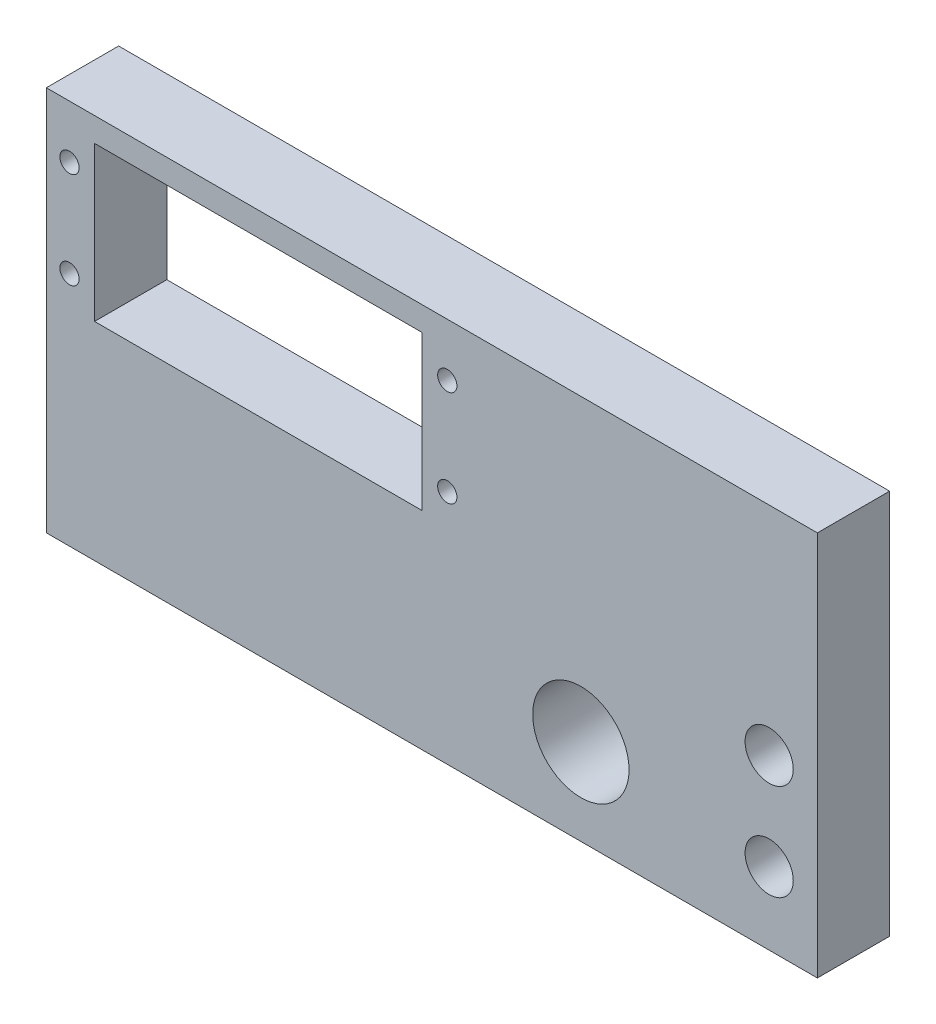
ISO-10303-21;
HEADER;
FILE_DESCRIPTION(('STEP AP214'),'2;1');
FILE_NAME('part.step','',(''),(''),'','','');
FILE_SCHEMA(('AUTOMOTIVE_DESIGN { 1 0 10303 214 1 1 1 1 }'));
ENDSEC;
DATA;
#1=APPLICATION_CONTEXT('core data for automotive mechanical design processes');
#2=APPLICATION_PROTOCOL_DEFINITION('international standard','automotive_design',2000,#1);
#3=PRODUCT_CONTEXT('',#1,'mechanical');
#4=PRODUCT('Part','Part','',(#3));
#5=PRODUCT_RELATED_PRODUCT_CATEGORY('part','',(#4));
#6=PRODUCT_DEFINITION_FORMATION('','',#4);
#7=PRODUCT_DEFINITION_CONTEXT('part definition',#1,'design');
#8=PRODUCT_DEFINITION('design','',#6,#7);
#9=PRODUCT_DEFINITION_SHAPE('','',#8);
#10=(LENGTH_UNIT() NAMED_UNIT(*) SI_UNIT(.MILLI.,.METRE.));
#11=(NAMED_UNIT(*) PLANE_ANGLE_UNIT() SI_UNIT($,.RADIAN.));
#12=(NAMED_UNIT(*) SI_UNIT($,.STERADIAN.) SOLID_ANGLE_UNIT());
#13=UNCERTAINTY_MEASURE_WITH_UNIT(LENGTH_MEASURE(1.E-05),#10,'distance_accuracy_value','');
#14=(GEOMETRIC_REPRESENTATION_CONTEXT(3) GLOBAL_UNCERTAINTY_ASSIGNED_CONTEXT((#13)) GLOBAL_UNIT_ASSIGNED_CONTEXT((#10,
#11,#12)) REPRESENTATION_CONTEXT('',''));
#15=CARTESIAN_POINT('',(0.,0.,0.));
#16=DIRECTION('',(0.,0.,1.));
#17=DIRECTION('',(1.,0.,0.));
#18=AXIS2_PLACEMENT_3D('',#15,#16,#17);
#19=CARTESIAN_POINT('',(0.,0.,9.525));
#20=DIRECTION('',(0.,0.,-1.));
#21=DIRECTION('',(-1.,0.,0.));
#22=AXIS2_PLACEMENT_3D('',#19,#20,#21);
#23=PLANE('',#22);
#24=CARTESIAN_POINT('',(52.832,31.115,9.525));
#25=DIRECTION('',(0.,0.,1.));
#26=DIRECTION('',(1.,0.,0.));
#27=AXIS2_PLACEMENT_3D('',#24,#25,#26);
#28=CIRCLE('',#27,1.27);
#29=CARTESIAN_POINT('',(54.102,31.115,9.525));
#30=VERTEX_POINT('',#29);
#31=EDGE_CURVE('E287',#30,#30,#28,.T.);
#32=ORIENTED_EDGE('',*,*,#31,.F.);
#33=EDGE_LOOP('',(#32));
#34=FACE_BOUND('',#33,.T.);
#35=CARTESIAN_POINT('',(3.04799999999999,31.115,9.525));
#36=DIRECTION('',(0.,0.,1.));
#37=DIRECTION('',(1.,0.,0.));
#38=AXIS2_PLACEMENT_3D('',#35,#36,#37);
#39=CIRCLE('',#38,1.27);
#40=CARTESIAN_POINT('',(4.31799999999999,31.115,9.525));
#41=VERTEX_POINT('',#40);
#42=EDGE_CURVE('E299',#41,#41,#39,.T.);
#43=ORIENTED_EDGE('',*,*,#42,.F.);
#44=EDGE_LOOP('',(#43));
#45=FACE_BOUND('',#44,.T.);
#46=CARTESIAN_POINT('',(95.25,9.525,9.525));
#47=DIRECTION('',(0.,0.,1.));
#48=DIRECTION('',(1.,0.,0.));
#49=AXIS2_PLACEMENT_3D('',#46,#47,#48);
#50=CIRCLE('',#49,3.175);
#51=CARTESIAN_POINT('',(98.425,9.525,9.525));
#52=VERTEX_POINT('',#51);
#53=EDGE_CURVE('E311',#52,#52,#50,.T.);
#54=ORIENTED_EDGE('',*,*,#53,.F.);
#55=EDGE_LOOP('',(#54));
#56=FACE_BOUND('',#55,.T.);
#57=DIRECTION('',(0.,-1.,0.));
#58=VECTOR('',#57,1.);
#59=CARTESIAN_POINT('',(6.35,47.625,9.525));
#60=LINE('',#59,#58);
#61=CARTESIAN_POINT('',(6.35,47.625,9.525));
#62=VERTEX_POINT('',#61);
#63=CARTESIAN_POINT('',(6.35,27.305,9.525));
#64=VERTEX_POINT('',#63);
#65=EDGE_CURVE('E99',#62,#64,#60,.T.);
#66=ORIENTED_EDGE('',*,*,#65,.F.);
#67=DIRECTION('',(-1.,0.,0.));
#68=VECTOR('',#67,1.);
#69=CARTESIAN_POINT('',(6.35,47.625,9.525));
#70=LINE('',#69,#68);
#71=CARTESIAN_POINT('',(49.53,47.625,9.525));
#72=VERTEX_POINT('',#71);
#73=EDGE_CURVE('E122',#72,#62,#70,.T.);
#74=ORIENTED_EDGE('',*,*,#73,.F.);
#75=DIRECTION('',(0.,1.,0.));
#76=VECTOR('',#75,1.);
#77=CARTESIAN_POINT('',(49.53,47.625,9.525));
#78=LINE('',#77,#76);
#79=CARTESIAN_POINT('',(49.53,27.305,9.525));
#80=VERTEX_POINT('',#79);
#81=EDGE_CURVE('E120',#80,#72,#78,.T.);
#82=ORIENTED_EDGE('',*,*,#81,.F.);
#83=DIRECTION('',(1.,0.,0.));
#84=VECTOR('',#83,1.);
#85=CARTESIAN_POINT('',(6.35,27.305,9.525));
#86=LINE('',#85,#84);
#87=EDGE_CURVE('E107',#64,#80,#86,.T.);
#88=ORIENTED_EDGE('',*,*,#87,.F.);
#89=EDGE_LOOP('',(#66,#74,#82,#88));
#90=FACE_BOUND('',#89,.T.);
#91=DIRECTION('',(0.,-1.,0.));
#92=VECTOR('',#91,1.);
#93=CARTESIAN_POINT('',(0.,0.,9.525));
#94=LINE('',#93,#92);
#95=CARTESIAN_POINT('',(0.,50.8,9.525));
#96=VERTEX_POINT('',#95);
#97=CARTESIAN_POINT('',(0.,0.,9.525));
#98=VERTEX_POINT('',#97);
#99=EDGE_CURVE('E138',#96,#98,#94,.T.);
#100=ORIENTED_EDGE('',*,*,#99,.T.);
#101=DIRECTION('',(1.,0.,0.));
#102=VECTOR('',#101,1.);
#103=CARTESIAN_POINT('',(0.,0.,9.525));
#104=LINE('',#103,#102);
#105=CARTESIAN_POINT('',(101.6,0.,9.525));
#106=VERTEX_POINT('',#105);
#107=EDGE_CURVE('E141',#98,#106,#104,.T.);
#108=ORIENTED_EDGE('',*,*,#107,.T.);
#109=DIRECTION('',(0.,1.,0.));
#110=VECTOR('',#109,1.);
#111=CARTESIAN_POINT('',(101.6,0.,9.525));
#112=LINE('',#111,#110);
#113=CARTESIAN_POINT('',(101.6,50.8,9.525));
#114=VERTEX_POINT('',#113);
#115=EDGE_CURVE('E144',#106,#114,#112,.T.);
#116=ORIENTED_EDGE('',*,*,#115,.T.);
#117=DIRECTION('',(-1.,0.,0.));
#118=VECTOR('',#117,1.);
#119=CARTESIAN_POINT('',(0.,50.8,9.525));
#120=LINE('',#119,#118);
#121=EDGE_CURVE('E146',#114,#96,#120,.T.);
#122=ORIENTED_EDGE('',*,*,#121,.T.);
#123=EDGE_LOOP('',(#100,#108,#116,#122));
#124=FACE_BOUND('',#123,.T.);
#125=CARTESIAN_POINT('',(95.25,22.225,9.525));
#126=DIRECTION('',(0.,0.,1.));
#127=DIRECTION('',(1.,0.,0.));
#128=AXIS2_PLACEMENT_3D('',#125,#126,#127);
#129=CIRCLE('',#128,3.175);
#130=CARTESIAN_POINT('',(98.425,22.225,9.525));
#131=VERTEX_POINT('',#130);
#132=EDGE_CURVE('E128',#131,#131,#129,.T.);
#133=ORIENTED_EDGE('',*,*,#132,.F.);
#134=EDGE_LOOP('',(#133));
#135=FACE_BOUND('',#134,.T.);
#136=CARTESIAN_POINT('',(3.04799999999999,43.815,9.525));
#137=DIRECTION('',(0.,0.,1.));
#138=DIRECTION('',(1.,0.,0.));
#139=AXIS2_PLACEMENT_3D('',#136,#137,#138);
#140=CIRCLE('',#139,1.27);
#141=CARTESIAN_POINT('',(4.31799999999999,43.815,9.525));
#142=VERTEX_POINT('',#141);
#143=EDGE_CURVE('E305',#142,#142,#140,.T.);
#144=ORIENTED_EDGE('',*,*,#143,.F.);
#145=EDGE_LOOP('',(#144));
#146=FACE_BOUND('',#145,.T.);
#147=CARTESIAN_POINT('',(52.832,43.815,9.525));
#148=DIRECTION('',(0.,0.,1.));
#149=DIRECTION('',(1.,0.,0.));
#150=AXIS2_PLACEMENT_3D('',#147,#148,#149);
#151=CIRCLE('',#150,1.27);
#152=CARTESIAN_POINT('',(54.102,43.815,9.525));
#153=VERTEX_POINT('',#152);
#154=EDGE_CURVE('E293',#153,#153,#151,.T.);
#155=ORIENTED_EDGE('',*,*,#154,.F.);
#156=EDGE_LOOP('',(#155));
#157=FACE_BOUND('',#156,.T.);
#158=CARTESIAN_POINT('',(70.435623445654,11.3491272882129,9.525));
#159=DIRECTION('',(0.,0.,1.));
#160=DIRECTION('',(1.,0.,0.));
#161=AXIS2_PLACEMENT_3D('',#158,#159,#160);
#162=CIRCLE('',#161,6.35);
#163=CARTESIAN_POINT('',(76.785623445654,11.3491272882129,9.525));
#164=VERTEX_POINT('',#163);
#165=EDGE_CURVE('E281',#164,#164,#162,.T.);
#166=ORIENTED_EDGE('',*,*,#165,.F.);
#167=EDGE_LOOP('',(#166));
#168=FACE_BOUND('',#167,.T.);
#169=ADVANCED_FACE('F34',(#34,#45,#56,#90,#124,#135,#146,#157,#168),#23,.F.);
#170=CARTESIAN_POINT('',(0.,0.,0.));
#171=DIRECTION('',(0.,0.,-1.));
#172=DIRECTION('',(-1.,0.,0.));
#173=AXIS2_PLACEMENT_3D('',#170,#171,#172);
#174=PLANE('',#173);
#175=CARTESIAN_POINT('',(52.832,31.115,0.));
#176=DIRECTION('',(0.,0.,1.));
#177=DIRECTION('',(1.,0.,0.));
#178=AXIS2_PLACEMENT_3D('',#175,#176,#177);
#179=CIRCLE('',#178,1.27);
#180=CARTESIAN_POINT('',(54.102,31.115,0.));
#181=VERTEX_POINT('',#180);
#182=EDGE_CURVE('E284',#181,#181,#179,.T.);
#183=ORIENTED_EDGE('',*,*,#182,.T.);
#184=EDGE_LOOP('',(#183));
#185=FACE_BOUND('',#184,.T.);
#186=CARTESIAN_POINT('',(3.04799999999999,31.115,0.));
#187=DIRECTION('',(0.,0.,1.));
#188=DIRECTION('',(1.,0.,0.));
#189=AXIS2_PLACEMENT_3D('',#186,#187,#188);
#190=CIRCLE('',#189,1.27);
#191=CARTESIAN_POINT('',(4.31799999999999,31.115,0.));
#192=VERTEX_POINT('',#191);
#193=EDGE_CURVE('E296',#192,#192,#190,.T.);
#194=ORIENTED_EDGE('',*,*,#193,.T.);
#195=EDGE_LOOP('',(#194));
#196=FACE_BOUND('',#195,.T.);
#197=CARTESIAN_POINT('',(95.25,9.525,0.));
#198=DIRECTION('',(0.,0.,1.));
#199=DIRECTION('',(1.,0.,0.));
#200=AXIS2_PLACEMENT_3D('',#197,#198,#199);
#201=CIRCLE('',#200,3.175);
#202=CARTESIAN_POINT('',(98.425,9.525,0.));
#203=VERTEX_POINT('',#202);
#204=EDGE_CURVE('E308',#203,#203,#201,.T.);
#205=ORIENTED_EDGE('',*,*,#204,.T.);
#206=EDGE_LOOP('',(#205));
#207=FACE_BOUND('',#206,.T.);
#208=DIRECTION('',(-1.,0.,0.));
#209=VECTOR('',#208,1.);
#210=CARTESIAN_POINT('',(6.35,47.625,0.));
#211=LINE('',#210,#209);
#212=CARTESIAN_POINT('',(49.53,47.625,0.));
#213=VERTEX_POINT('',#212);
#214=CARTESIAN_POINT('',(6.35,47.625,0.));
#215=VERTEX_POINT('',#214);
#216=EDGE_CURVE('E108',#213,#215,#211,.T.);
#217=ORIENTED_EDGE('',*,*,#216,.T.);
#218=DIRECTION('',(0.,-1.,0.));
#219=VECTOR('',#218,1.);
#220=CARTESIAN_POINT('',(6.35,47.625,0.));
#221=LINE('',#220,#219);
#222=CARTESIAN_POINT('',(6.35,27.305,0.));
#223=VERTEX_POINT('',#222);
#224=EDGE_CURVE('E57',#215,#223,#221,.T.);
#225=ORIENTED_EDGE('',*,*,#224,.T.);
#226=DIRECTION('',(1.,0.,0.));
#227=VECTOR('',#226,1.);
#228=CARTESIAN_POINT('',(6.35,27.305,0.));
#229=LINE('',#228,#227);
#230=CARTESIAN_POINT('',(49.53,27.305,0.));
#231=VERTEX_POINT('',#230);
#232=EDGE_CURVE('E114',#223,#231,#229,.T.);
#233=ORIENTED_EDGE('',*,*,#232,.T.);
#234=DIRECTION('',(0.,1.,0.));
#235=VECTOR('',#234,1.);
#236=CARTESIAN_POINT('',(49.53,47.625,0.));
#237=LINE('',#236,#235);
#238=EDGE_CURVE('E130',#231,#213,#237,.T.);
#239=ORIENTED_EDGE('',*,*,#238,.T.);
#240=EDGE_LOOP('',(#217,#225,#233,#239));
#241=FACE_BOUND('',#240,.T.);
#242=DIRECTION('',(0.,-1.,0.));
#243=VECTOR('',#242,1.);
#244=CARTESIAN_POINT('',(0.,0.,0.));
#245=LINE('',#244,#243);
#246=CARTESIAN_POINT('',(0.,50.8,0.));
#247=VERTEX_POINT('',#246);
#248=CARTESIAN_POINT('',(0.,0.,0.));
#249=VERTEX_POINT('',#248);
#250=EDGE_CURVE('E115',#247,#249,#245,.T.);
#251=ORIENTED_EDGE('',*,*,#250,.F.);
#252=DIRECTION('',(-1.,0.,0.));
#253=VECTOR('',#252,1.);
#254=CARTESIAN_POINT('',(0.,50.8,0.));
#255=LINE('',#254,#253);
#256=CARTESIAN_POINT('',(101.6,50.8,0.));
#257=VERTEX_POINT('',#256);
#258=EDGE_CURVE('E142',#257,#247,#255,.T.);
#259=ORIENTED_EDGE('',*,*,#258,.F.);
#260=DIRECTION('',(0.,1.,0.));
#261=VECTOR('',#260,1.);
#262=CARTESIAN_POINT('',(101.6,0.,0.));
#263=LINE('',#262,#261);
#264=CARTESIAN_POINT('',(101.6,0.,0.));
#265=VERTEX_POINT('',#264);
#266=EDGE_CURVE('E153',#265,#257,#263,.T.);
#267=ORIENTED_EDGE('',*,*,#266,.F.);
#268=DIRECTION('',(1.,0.,0.));
#269=VECTOR('',#268,1.);
#270=CARTESIAN_POINT('',(0.,0.,0.));
#271=LINE('',#270,#269);
#272=EDGE_CURVE('E151',#249,#265,#271,.T.);
#273=ORIENTED_EDGE('',*,*,#272,.F.);
#274=EDGE_LOOP('',(#251,#259,#267,#273));
#275=FACE_BOUND('',#274,.T.);
#276=CARTESIAN_POINT('',(95.25,22.225,0.));
#277=DIRECTION('',(0.,0.,1.));
#278=DIRECTION('',(1.,0.,0.));
#279=AXIS2_PLACEMENT_3D('',#276,#277,#278);
#280=CIRCLE('',#279,3.175);
#281=CARTESIAN_POINT('',(98.425,22.225,0.));
#282=VERTEX_POINT('',#281);
#283=EDGE_CURVE('E314',#282,#282,#280,.T.);
#284=ORIENTED_EDGE('',*,*,#283,.T.);
#285=EDGE_LOOP('',(#284));
#286=FACE_BOUND('',#285,.T.);
#287=CARTESIAN_POINT('',(3.04799999999999,43.815,0.));
#288=DIRECTION('',(0.,0.,1.));
#289=DIRECTION('',(1.,0.,0.));
#290=AXIS2_PLACEMENT_3D('',#287,#288,#289);
#291=CIRCLE('',#290,1.27);
#292=CARTESIAN_POINT('',(4.31799999999999,43.815,0.));
#293=VERTEX_POINT('',#292);
#294=EDGE_CURVE('E302',#293,#293,#291,.T.);
#295=ORIENTED_EDGE('',*,*,#294,.T.);
#296=EDGE_LOOP('',(#295));
#297=FACE_BOUND('',#296,.T.);
#298=CARTESIAN_POINT('',(52.832,43.815,0.));
#299=DIRECTION('',(0.,0.,1.));
#300=DIRECTION('',(1.,0.,0.));
#301=AXIS2_PLACEMENT_3D('',#298,#299,#300);
#302=CIRCLE('',#301,1.27);
#303=CARTESIAN_POINT('',(54.102,43.815,0.));
#304=VERTEX_POINT('',#303);
#305=EDGE_CURVE('E290',#304,#304,#302,.T.);
#306=ORIENTED_EDGE('',*,*,#305,.T.);
#307=EDGE_LOOP('',(#306));
#308=FACE_BOUND('',#307,.T.);
#309=CARTESIAN_POINT('',(70.435623445654,11.3491272882129,0.));
#310=DIRECTION('',(0.,0.,1.));
#311=DIRECTION('',(1.,0.,0.));
#312=AXIS2_PLACEMENT_3D('',#309,#310,#311);
#313=CIRCLE('',#312,6.35);
#314=CARTESIAN_POINT('',(76.785623445654,11.3491272882129,0.));
#315=VERTEX_POINT('',#314);
#316=EDGE_CURVE('E279',#315,#315,#313,.T.);
#317=ORIENTED_EDGE('',*,*,#316,.T.);
#318=EDGE_LOOP('',(#317));
#319=FACE_BOUND('',#318,.T.);
#320=ADVANCED_FACE('F171',(#185,#196,#207,#241,#275,#286,#297,#308,#319),#174,.T.);
#321=CARTESIAN_POINT('',(0.,0.,9.525));
#322=DIRECTION('',(1.,0.,0.));
#323=DIRECTION('',(0.,0.,-1.));
#324=AXIS2_PLACEMENT_3D('',#321,#322,#323);
#325=PLANE('',#324);
#326=ORIENTED_EDGE('',*,*,#250,.T.);
#327=DIRECTION('',(0.,0.,-1.));
#328=VECTOR('',#327,1.);
#329=CARTESIAN_POINT('',(0.,0.,9.525));
#330=LINE('',#329,#328);
#331=EDGE_CURVE('E11',#98,#249,#330,.T.);
#332=ORIENTED_EDGE('',*,*,#331,.F.);
#333=ORIENTED_EDGE('',*,*,#99,.F.);
#334=DIRECTION('',(0.,0.,-1.));
#335=VECTOR('',#334,1.);
#336=CARTESIAN_POINT('',(0.,50.8,9.525));
#337=LINE('',#336,#335);
#338=EDGE_CURVE('E148',#96,#247,#337,.T.);
#339=ORIENTED_EDGE('',*,*,#338,.T.);
#340=EDGE_LOOP('',(#326,#332,#333,#339));
#341=FACE_BOUND('',#340,.T.);
#342=ADVANCED_FACE('F36',(#341),#325,.F.);
#343=CARTESIAN_POINT('',(0.,0.,9.525));
#344=DIRECTION('',(0.,1.,0.));
#345=DIRECTION('',(0.,0.,1.));
#346=AXIS2_PLACEMENT_3D('',#343,#344,#345);
#347=PLANE('',#346);
#348=CARTESIAN_POINT('',(79.2988,0.,4.7625));
#349=DIRECTION('',(0.,-1.,0.));
#350=DIRECTION('',(0.,0.,-1.));
#351=AXIS2_PLACEMENT_3D('',#348,#349,#350);
#352=CIRCLE('',#351,1.7272);
#353=CARTESIAN_POINT('',(79.2988,0.,3.0353));
#354=VERTEX_POINT('',#353);
#355=EDGE_CURVE('E270',#354,#354,#352,.T.);
#356=ORIENTED_EDGE('',*,*,#355,.F.);
#357=EDGE_LOOP('',(#356));
#358=FACE_BOUND('',#357,.T.);
#359=CARTESIAN_POINT('',(60.2488,0.,4.7625));
#360=DIRECTION('',(0.,-1.,0.));
#361=DIRECTION('',(0.,0.,-1.));
#362=AXIS2_PLACEMENT_3D('',#359,#360,#361);
#363=CIRCLE('',#362,1.7272);
#364=CARTESIAN_POINT('',(60.2488,0.,3.0353));
#365=VERTEX_POINT('',#364);
#366=EDGE_CURVE('E269',#365,#365,#363,.T.);
#367=ORIENTED_EDGE('',*,*,#366,.F.);
#368=EDGE_LOOP('',(#367));
#369=FACE_BOUND('',#368,.T.);
#370=ORIENTED_EDGE('',*,*,#272,.T.);
#371=DIRECTION('',(0.,0.,-1.));
#372=VECTOR('',#371,1.);
#373=CARTESIAN_POINT('',(101.6,0.,9.525));
#374=LINE('',#373,#372);
#375=EDGE_CURVE('E42',#106,#265,#374,.T.);
#376=ORIENTED_EDGE('',*,*,#375,.F.);
#377=ORIENTED_EDGE('',*,*,#107,.F.);
#378=ORIENTED_EDGE('',*,*,#331,.T.);
#379=EDGE_LOOP('',(#370,#376,#377,#378));
#380=FACE_BOUND('',#379,.T.);
#381=ADVANCED_FACE('F181',(#358,#369,#380),#347,.F.);
#382=CARTESIAN_POINT('',(101.6,0.,9.525));
#383=DIRECTION('',(-1.,0.,0.));
#384=DIRECTION('',(0.,0.,1.));
#385=AXIS2_PLACEMENT_3D('',#382,#383,#384);
#386=PLANE('',#385);
#387=ORIENTED_EDGE('',*,*,#266,.T.);
#388=DIRECTION('',(0.,0.,-1.));
#389=VECTOR('',#388,1.);
#390=CARTESIAN_POINT('',(101.6,50.8,9.525));
#391=LINE('',#390,#389);
#392=EDGE_CURVE('E158',#114,#257,#391,.T.);
#393=ORIENTED_EDGE('',*,*,#392,.F.);
#394=ORIENTED_EDGE('',*,*,#115,.F.);
#395=ORIENTED_EDGE('',*,*,#375,.T.);
#396=EDGE_LOOP('',(#387,#393,#394,#395));
#397=FACE_BOUND('',#396,.T.);
#398=ADVANCED_FACE('F165',(#397),#386,.F.);
#399=CARTESIAN_POINT('',(0.,50.8,9.525));
#400=DIRECTION('',(0.,-1.,0.));
#401=DIRECTION('',(0.,0.,-1.));
#402=AXIS2_PLACEMENT_3D('',#399,#400,#401);
#403=PLANE('',#402);
#404=ORIENTED_EDGE('',*,*,#258,.T.);
#405=ORIENTED_EDGE('',*,*,#338,.F.);
#406=ORIENTED_EDGE('',*,*,#121,.F.);
#407=ORIENTED_EDGE('',*,*,#392,.T.);
#408=EDGE_LOOP('',(#404,#405,#406,#407));
#409=FACE_BOUND('',#408,.T.);
#410=ADVANCED_FACE('F175',(#409),#403,.F.);
#411=CARTESIAN_POINT('',(6.35,47.625,9.525));
#412=DIRECTION('',(1.,0.,0.));
#413=DIRECTION('',(0.,1.,0.));
#414=AXIS2_PLACEMENT_3D('',#411,#412,#413);
#415=PLANE('',#414);
#416=ORIENTED_EDGE('',*,*,#224,.F.);
#417=DIRECTION('',(0.,0.,-1.));
#418=VECTOR('',#417,1.);
#419=CARTESIAN_POINT('',(6.35,47.625,9.525));
#420=LINE('',#419,#418);
#421=EDGE_CURVE('E103',#62,#215,#420,.T.);
#422=ORIENTED_EDGE('',*,*,#421,.F.);
#423=ORIENTED_EDGE('',*,*,#65,.T.);
#424=DIRECTION('',(0.,0.,-1.));
#425=VECTOR('',#424,1.);
#426=CARTESIAN_POINT('',(6.35,27.305,9.525));
#427=LINE('',#426,#425);
#428=EDGE_CURVE('E102',#64,#223,#427,.T.);
#429=ORIENTED_EDGE('',*,*,#428,.T.);
#430=EDGE_LOOP('',(#416,#422,#423,#429));
#431=FACE_BOUND('',#430,.T.);
#432=ADVANCED_FACE('F101',(#431),#415,.T.);
#433=CARTESIAN_POINT('',(6.35,27.305,9.525));
#434=DIRECTION('',(0.,1.,0.));
#435=DIRECTION('',(0.,0.,1.));
#436=AXIS2_PLACEMENT_3D('',#433,#434,#435);
#437=PLANE('',#436);
#438=ORIENTED_EDGE('',*,*,#232,.F.);
#439=ORIENTED_EDGE('',*,*,#428,.F.);
#440=ORIENTED_EDGE('',*,*,#87,.T.);
#441=DIRECTION('',(0.,0.,-1.));
#442=VECTOR('',#441,1.);
#443=CARTESIAN_POINT('',(49.53,27.305,9.525));
#444=LINE('',#443,#442);
#445=EDGE_CURVE('E116',#80,#231,#444,.T.);
#446=ORIENTED_EDGE('',*,*,#445,.T.);
#447=EDGE_LOOP('',(#438,#439,#440,#446));
#448=FACE_BOUND('',#447,.T.);
#449=ADVANCED_FACE('F111',(#448),#437,.T.);
#450=CARTESIAN_POINT('',(49.53,47.625,9.525));
#451=DIRECTION('',(-1.,0.,0.));
#452=DIRECTION('',(0.,0.,1.));
#453=AXIS2_PLACEMENT_3D('',#450,#451,#452);
#454=PLANE('',#453);
#455=ORIENTED_EDGE('',*,*,#238,.F.);
#456=ORIENTED_EDGE('',*,*,#445,.F.);
#457=ORIENTED_EDGE('',*,*,#81,.T.);
#458=DIRECTION('',(0.,0.,-1.));
#459=VECTOR('',#458,1.);
#460=CARTESIAN_POINT('',(49.53,47.625,9.525));
#461=LINE('',#460,#459);
#462=EDGE_CURVE('E49',#72,#213,#461,.T.);
#463=ORIENTED_EDGE('',*,*,#462,.T.);
#464=EDGE_LOOP('',(#455,#456,#457,#463));
#465=FACE_BOUND('',#464,.T.);
#466=ADVANCED_FACE('F211',(#465),#454,.T.);
#467=CARTESIAN_POINT('',(6.35,47.625,9.525));
#468=DIRECTION('',(0.,-1.,0.));
#469=DIRECTION('',(0.,0.,-1.));
#470=AXIS2_PLACEMENT_3D('',#467,#468,#469);
#471=PLANE('',#470);
#472=ORIENTED_EDGE('',*,*,#216,.F.);
#473=ORIENTED_EDGE('',*,*,#462,.F.);
#474=ORIENTED_EDGE('',*,*,#73,.T.);
#475=ORIENTED_EDGE('',*,*,#421,.T.);
#476=EDGE_LOOP('',(#472,#473,#474,#475));
#477=FACE_BOUND('',#476,.T.);
#478=ADVANCED_FACE('F215',(#477),#471,.T.);
#479=CARTESIAN_POINT('',(95.25,22.225,9.525));
#480=DIRECTION('',(0.,0.,-1.));
#481=DIRECTION('',(-1.,0.,0.));
#482=AXIS2_PLACEMENT_3D('',#479,#480,#481);
#483=CYLINDRICAL_SURFACE('',#482,3.175);
#484=ORIENTED_EDGE('',*,*,#132,.T.);
#485=EDGE_LOOP('',(#484));
#486=FACE_BOUND('',#485,.T.);
#487=ORIENTED_EDGE('',*,*,#283,.F.);
#488=EDGE_LOOP('',(#487));
#489=FACE_BOUND('',#488,.T.);
#490=ADVANCED_FACE('F221',(#486,#489),#483,.F.);
#491=CARTESIAN_POINT('',(95.25,9.525,9.525));
#492=DIRECTION('',(0.,0.,-1.));
#493=DIRECTION('',(-1.,0.,0.));
#494=AXIS2_PLACEMENT_3D('',#491,#492,#493);
#495=CYLINDRICAL_SURFACE('',#494,3.175);
#496=ORIENTED_EDGE('',*,*,#53,.T.);
#497=EDGE_LOOP('',(#496));
#498=FACE_BOUND('',#497,.T.);
#499=ORIENTED_EDGE('',*,*,#204,.F.);
#500=EDGE_LOOP('',(#499));
#501=FACE_BOUND('',#500,.T.);
#502=ADVANCED_FACE('F224',(#498,#501),#495,.F.);
#503=CARTESIAN_POINT('',(3.04799999999999,43.815,9.525));
#504=DIRECTION('',(0.,0.,-1.));
#505=DIRECTION('',(-1.,0.,0.));
#506=AXIS2_PLACEMENT_3D('',#503,#504,#505);
#507=CYLINDRICAL_SURFACE('',#506,1.27);
#508=ORIENTED_EDGE('',*,*,#143,.T.);
#509=EDGE_LOOP('',(#508));
#510=FACE_BOUND('',#509,.T.);
#511=ORIENTED_EDGE('',*,*,#294,.F.);
#512=EDGE_LOOP('',(#511));
#513=FACE_BOUND('',#512,.T.);
#514=ADVANCED_FACE('F228',(#510,#513),#507,.F.);
#515=CARTESIAN_POINT('',(3.04799999999999,31.115,9.525));
#516=DIRECTION('',(0.,0.,-1.));
#517=DIRECTION('',(-1.,0.,0.));
#518=AXIS2_PLACEMENT_3D('',#515,#516,#517);
#519=CYLINDRICAL_SURFACE('',#518,1.27);
#520=ORIENTED_EDGE('',*,*,#42,.T.);
#521=EDGE_LOOP('',(#520));
#522=FACE_BOUND('',#521,.T.);
#523=ORIENTED_EDGE('',*,*,#193,.F.);
#524=EDGE_LOOP('',(#523));
#525=FACE_BOUND('',#524,.T.);
#526=ADVANCED_FACE('F232',(#522,#525),#519,.F.);
#527=CARTESIAN_POINT('',(52.832,43.815,9.525));
#528=DIRECTION('',(0.,0.,-1.));
#529=DIRECTION('',(-1.,0.,0.));
#530=AXIS2_PLACEMENT_3D('',#527,#528,#529);
#531=CYLINDRICAL_SURFACE('',#530,1.27);
#532=ORIENTED_EDGE('',*,*,#154,.T.);
#533=EDGE_LOOP('',(#532));
#534=FACE_BOUND('',#533,.T.);
#535=ORIENTED_EDGE('',*,*,#305,.F.);
#536=EDGE_LOOP('',(#535));
#537=FACE_BOUND('',#536,.T.);
#538=ADVANCED_FACE('F236',(#534,#537),#531,.F.);
#539=CARTESIAN_POINT('',(52.832,31.115,9.525));
#540=DIRECTION('',(0.,0.,-1.));
#541=DIRECTION('',(-1.,0.,0.));
#542=AXIS2_PLACEMENT_3D('',#539,#540,#541);
#543=CYLINDRICAL_SURFACE('',#542,1.27);
#544=ORIENTED_EDGE('',*,*,#31,.T.);
#545=EDGE_LOOP('',(#544));
#546=FACE_BOUND('',#545,.T.);
#547=ORIENTED_EDGE('',*,*,#182,.F.);
#548=EDGE_LOOP('',(#547));
#549=FACE_BOUND('',#548,.T.);
#550=ADVANCED_FACE('F240',(#546,#549),#543,.F.);
#551=CARTESIAN_POINT('',(70.435623445654,11.3491272882129,9.525));
#552=DIRECTION('',(0.,0.,-1.));
#553=DIRECTION('',(-1.,0.,0.));
#554=AXIS2_PLACEMENT_3D('',#551,#552,#553);
#555=CYLINDRICAL_SURFACE('',#554,6.35);
#556=ORIENTED_EDGE('',*,*,#165,.T.);
#557=EDGE_LOOP('',(#556));
#558=FACE_BOUND('',#557,.T.);
#559=ORIENTED_EDGE('',*,*,#316,.F.);
#560=EDGE_LOOP('',(#559));
#561=FACE_BOUND('',#560,.T.);
#562=ADVANCED_FACE('F244',(#558,#561),#555,.F.);
#563=CARTESIAN_POINT('',(60.2488,12.7,4.7625));
#564=DIRECTION('',(0.,-1.,0.));
#565=DIRECTION('',(0.,0.,-1.));
#566=AXIS2_PLACEMENT_3D('',#563,#564,#565);
#567=CYLINDRICAL_SURFACE('',#566,1.7272);
#568=CARTESIAN_POINT('',(60.2488,12.7,4.7625));
#569=DIRECTION('',(0.,-1.,0.));
#570=DIRECTION('',(0.,0.,-1.));
#571=AXIS2_PLACEMENT_3D('',#568,#569,#570);
#572=CIRCLE('',#571,1.7272);
#573=CARTESIAN_POINT('',(60.2488,12.7,3.0353));
#574=VERTEX_POINT('',#573);
#575=EDGE_CURVE('E273',#574,#574,#572,.T.);
#576=ORIENTED_EDGE('',*,*,#575,.F.);
#577=EDGE_LOOP('',(#576));
#578=FACE_BOUND('',#577,.T.);
#579=ORIENTED_EDGE('',*,*,#366,.T.);
#580=EDGE_LOOP('',(#579));
#581=FACE_BOUND('',#580,.T.);
#582=ADVANCED_FACE('F248',(#578,#581),#567,.F.);
#583=CARTESIAN_POINT('',(60.2488,12.7,4.7625));
#584=DIRECTION('',(0.,-1.,0.));
#585=DIRECTION('',(0.,0.,-1.));
#586=AXIS2_PLACEMENT_3D('',#583,#584,#585);
#587=PLANE('',#586);
#588=ORIENTED_EDGE('',*,*,#575,.T.);
#589=EDGE_LOOP('',(#588));
#590=FACE_BOUND('',#589,.T.);
#591=ADVANCED_FACE('F252',(#590),#587,.T.);
#592=CARTESIAN_POINT('',(79.2988,12.7,4.7625));
#593=DIRECTION('',(0.,-1.,0.));
#594=DIRECTION('',(0.,0.,-1.));
#595=AXIS2_PLACEMENT_3D('',#592,#593,#594);
#596=CYLINDRICAL_SURFACE('',#595,1.7272);
#597=CARTESIAN_POINT('',(79.2988,12.7,4.7625));
#598=DIRECTION('',(0.,-1.,0.));
#599=DIRECTION('',(0.,0.,-1.));
#600=AXIS2_PLACEMENT_3D('',#597,#598,#599);
#601=CIRCLE('',#600,1.7272);
#602=CARTESIAN_POINT('',(79.2988,12.7,3.0353));
#603=VERTEX_POINT('',#602);
#604=EDGE_CURVE('E268',#603,#603,#601,.T.);
#605=ORIENTED_EDGE('',*,*,#604,.F.);
#606=EDGE_LOOP('',(#605));
#607=FACE_BOUND('',#606,.T.);
#608=ORIENTED_EDGE('',*,*,#355,.T.);
#609=EDGE_LOOP('',(#608));
#610=FACE_BOUND('',#609,.T.);
#611=ADVANCED_FACE('F256',(#607,#610),#596,.F.);
#612=CARTESIAN_POINT('',(79.2988,12.7,4.7625));
#613=DIRECTION('',(0.,-1.,0.));
#614=DIRECTION('',(0.,0.,-1.));
#615=AXIS2_PLACEMENT_3D('',#612,#613,#614);
#616=PLANE('',#615);
#617=ORIENTED_EDGE('',*,*,#604,.T.);
#618=EDGE_LOOP('',(#617));
#619=FACE_BOUND('',#618,.T.);
#620=ADVANCED_FACE('F260',(#619),#616,.T.);
#621=CLOSED_SHELL('',(#169,#320,#342,#381,#398,#410,#432,#449,#466,#478,#490,#502,#514,#526,
#538,#550,#562,#582,#591,#611,#620));
#622=MANIFOLD_SOLID_BREP('B2',#621);
#623=ADVANCED_BREP_SHAPE_REPRESENTATION('',(#18,#622),#14);
#624=SHAPE_DEFINITION_REPRESENTATION(#9,#623);
ENDSEC;
END-ISO-10303-21;
